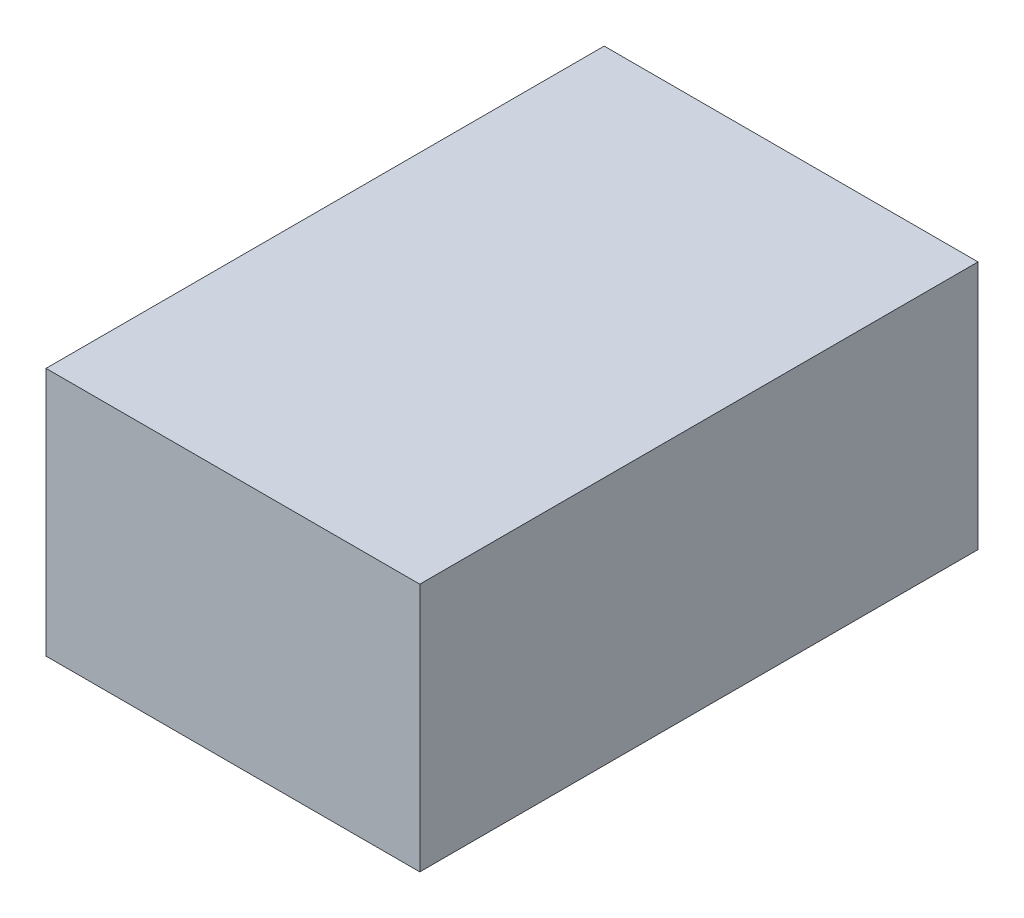
ISO-10303-21;
HEADER;
FILE_DESCRIPTION(('STEP AP214'),'2;1');
FILE_NAME('part.step','',(''),(''),'','','');
FILE_SCHEMA(('AUTOMOTIVE_DESIGN { 1 0 10303 214 1 1 1 1 }'));
ENDSEC;
DATA;
#1=APPLICATION_CONTEXT('core data for automotive mechanical design processes');
#2=APPLICATION_PROTOCOL_DEFINITION('international standard','automotive_design',2000,#1);
#3=PRODUCT_CONTEXT('',#1,'mechanical');
#4=PRODUCT('Part','Part','',(#3));
#5=PRODUCT_RELATED_PRODUCT_CATEGORY('part','',(#4));
#6=PRODUCT_DEFINITION_FORMATION('','',#4);
#7=PRODUCT_DEFINITION_CONTEXT('part definition',#1,'design');
#8=PRODUCT_DEFINITION('design','',#6,#7);
#9=PRODUCT_DEFINITION_SHAPE('','',#8);
#10=(LENGTH_UNIT() NAMED_UNIT(*) SI_UNIT(.MILLI.,.METRE.));
#11=(NAMED_UNIT(*) PLANE_ANGLE_UNIT() SI_UNIT($,.RADIAN.));
#12=(NAMED_UNIT(*) SI_UNIT($,.STERADIAN.) SOLID_ANGLE_UNIT());
#13=UNCERTAINTY_MEASURE_WITH_UNIT(LENGTH_MEASURE(1.E-05),#10,'distance_accuracy_value','');
#14=(GEOMETRIC_REPRESENTATION_CONTEXT(3) GLOBAL_UNCERTAINTY_ASSIGNED_CONTEXT((#13)) GLOBAL_UNIT_ASSIGNED_CONTEXT((#10,
#11,#12)) REPRESENTATION_CONTEXT('',''));
#15=CARTESIAN_POINT('',(0.,0.,0.));
#16=DIRECTION('',(0.,0.,1.));
#17=DIRECTION('',(1.,0.,0.));
#18=AXIS2_PLACEMENT_3D('',#15,#16,#17);
#19=CARTESIAN_POINT('',(25.14,2.77,14.48));
#20=DIRECTION('',(0.,1.,0.));
#21=DIRECTION('',(0.,0.,1.));
#22=AXIS2_PLACEMENT_3D('',#19,#20,#21);
#23=PLANE('',#22);
#24=DIRECTION('',(0.,0.,-1.));
#25=VECTOR('',#24,1.);
#26=CARTESIAN_POINT('',(29.78,2.77,15.6));
#27=LINE('',#26,#25);
#28=CARTESIAN_POINT('',(29.78,2.77,13.36));
#29=VERTEX_POINT('',#28);
#30=CARTESIAN_POINT('',(29.78,2.77,15.6));
#31=VERTEX_POINT('',#30);
#32=EDGE_CURVE('E20',#29,#31,#27,.F.);
#33=ORIENTED_EDGE('',*,*,#32,.F.);
#34=DIRECTION('',(-1.,0.,0.));
#35=VECTOR('',#34,1.);
#36=CARTESIAN_POINT('',(29.78,2.77,13.36));
#37=LINE('',#36,#35);
#38=CARTESIAN_POINT('',(28.28,2.77,13.36));
#39=VERTEX_POINT('',#38);
#40=EDGE_CURVE('E58',#39,#29,#37,.F.);
#41=ORIENTED_EDGE('',*,*,#40,.F.);
#42=DIRECTION('',(0.,0.,1.));
#43=VECTOR('',#42,1.);
#44=CARTESIAN_POINT('',(28.28,2.77,13.36));
#45=LINE('',#44,#43);
#46=CARTESIAN_POINT('',(28.28,2.77,15.6));
#47=VERTEX_POINT('',#46);
#48=EDGE_CURVE('E53',#47,#39,#45,.F.);
#49=ORIENTED_EDGE('',*,*,#48,.F.);
#50=DIRECTION('',(1.,0.,0.));
#51=VECTOR('',#50,1.);
#52=CARTESIAN_POINT('',(28.28,2.77,15.6));
#53=LINE('',#52,#51);
#54=EDGE_CURVE('E68',#31,#47,#53,.F.);
#55=ORIENTED_EDGE('',*,*,#54,.F.);
#56=EDGE_LOOP('',(#33,#41,#49,#55));
#57=FACE_BOUND('',#56,.T.);
#58=ADVANCED_FACE('F17',(#57),#23,.T.);
#59=CARTESIAN_POINT('',(29.78,1.77,15.6));
#60=DIRECTION('',(1.,0.,0.));
#61=DIRECTION('',(0.,0.,-1.));
#62=AXIS2_PLACEMENT_3D('',#59,#60,#61);
#63=PLANE('',#62);
#64=DIRECTION('',(0.,0.,1.));
#65=VECTOR('',#64,1.);
#66=CARTESIAN_POINT('',(29.78,1.77,14.48));
#67=LINE('',#66,#65);
#68=CARTESIAN_POINT('',(29.78,1.77,15.6));
#69=VERTEX_POINT('',#68);
#70=CARTESIAN_POINT('',(29.78,1.77,13.36));
#71=VERTEX_POINT('',#70);
#72=EDGE_CURVE('E74',#69,#71,#67,.F.);
#73=ORIENTED_EDGE('',*,*,#72,.T.);
#74=DIRECTION('',(0.,1.,0.));
#75=VECTOR('',#74,1.);
#76=CARTESIAN_POINT('',(29.78,1.77,13.36));
#77=LINE('',#76,#75);
#78=EDGE_CURVE('E63',#29,#71,#77,.F.);
#79=ORIENTED_EDGE('',*,*,#78,.F.);
#80=ORIENTED_EDGE('',*,*,#32,.T.);
#81=DIRECTION('',(0.,1.,0.));
#82=VECTOR('',#81,1.);
#83=CARTESIAN_POINT('',(29.78,1.77,15.6));
#84=LINE('',#83,#82);
#85=EDGE_CURVE('E81',#69,#31,#84,.T.);
#86=ORIENTED_EDGE('',*,*,#85,.F.);
#87=EDGE_LOOP('',(#73,#79,#80,#86));
#88=FACE_BOUND('',#87,.T.);
#89=ADVANCED_FACE('F73',(#88),#63,.T.);
#90=CARTESIAN_POINT('',(29.78,1.77,13.36));
#91=DIRECTION('',(0.,0.,-1.));
#92=DIRECTION('',(-1.,0.,0.));
#93=AXIS2_PLACEMENT_3D('',#90,#91,#92);
#94=PLANE('',#93);
#95=DIRECTION('',(1.,0.,0.));
#96=VECTOR('',#95,1.);
#97=CARTESIAN_POINT('',(29.03,1.77,13.36));
#98=LINE('',#97,#96);
#99=CARTESIAN_POINT('',(28.28,1.77,13.36));
#100=VERTEX_POINT('',#99);
#101=EDGE_CURVE('E84',#71,#100,#98,.F.);
#102=ORIENTED_EDGE('',*,*,#101,.T.);
#103=DIRECTION('',(0.,1.,0.));
#104=VECTOR('',#103,1.);
#105=CARTESIAN_POINT('',(28.28,1.77,13.36));
#106=LINE('',#105,#104);
#107=EDGE_CURVE('E65',#39,#100,#106,.F.);
#108=ORIENTED_EDGE('',*,*,#107,.F.);
#109=ORIENTED_EDGE('',*,*,#40,.T.);
#110=ORIENTED_EDGE('',*,*,#78,.T.);
#111=EDGE_LOOP('',(#102,#108,#109,#110));
#112=FACE_BOUND('',#111,.T.);
#113=ADVANCED_FACE('F61',(#112),#94,.T.);
#114=CARTESIAN_POINT('',(28.28,1.77,13.36));
#115=DIRECTION('',(-1.,0.,0.));
#116=DIRECTION('',(0.,0.,1.));
#117=AXIS2_PLACEMENT_3D('',#114,#115,#116);
#118=PLANE('',#117);
#119=DIRECTION('',(0.,0.,1.));
#120=VECTOR('',#119,1.);
#121=CARTESIAN_POINT('',(28.28,1.77,14.48));
#122=LINE('',#121,#120);
#123=CARTESIAN_POINT('',(28.28,1.77,15.6));
#124=VERTEX_POINT('',#123);
#125=EDGE_CURVE('E26',#100,#124,#122,.T.);
#126=ORIENTED_EDGE('',*,*,#125,.T.);
#127=DIRECTION('',(0.,1.,0.));
#128=VECTOR('',#127,1.);
#129=CARTESIAN_POINT('',(28.28,1.77,15.6));
#130=LINE('',#129,#128);
#131=EDGE_CURVE('E34',#47,#124,#130,.F.);
#132=ORIENTED_EDGE('',*,*,#131,.F.);
#133=ORIENTED_EDGE('',*,*,#48,.T.);
#134=ORIENTED_EDGE('',*,*,#107,.T.);
#135=EDGE_LOOP('',(#126,#132,#133,#134));
#136=FACE_BOUND('',#135,.T.);
#137=ADVANCED_FACE('F88',(#136),#118,.T.);
#138=CARTESIAN_POINT('',(28.28,1.77,15.6));
#139=DIRECTION('',(0.,0.,1.));
#140=DIRECTION('',(1.,0.,0.));
#141=AXIS2_PLACEMENT_3D('',#138,#139,#140);
#142=PLANE('',#141);
#143=DIRECTION('',(1.,0.,0.));
#144=VECTOR('',#143,1.);
#145=CARTESIAN_POINT('',(29.03,1.77,15.6));
#146=LINE('',#145,#144);
#147=EDGE_CURVE('E11',#124,#69,#146,.T.);
#148=ORIENTED_EDGE('',*,*,#147,.T.);
#149=ORIENTED_EDGE('',*,*,#85,.T.);
#150=ORIENTED_EDGE('',*,*,#54,.T.);
#151=ORIENTED_EDGE('',*,*,#131,.T.);
#152=EDGE_LOOP('',(#148,#149,#150,#151));
#153=FACE_BOUND('',#152,.T.);
#154=ADVANCED_FACE('F91',(#153),#142,.T.);
#155=CARTESIAN_POINT('',(29.03,1.77,14.48));
#156=DIRECTION('',(0.,1.,0.));
#157=DIRECTION('',(0.,0.,1.));
#158=AXIS2_PLACEMENT_3D('',#155,#156,#157);
#159=PLANE('',#158);
#160=ORIENTED_EDGE('',*,*,#125,.F.);
#161=ORIENTED_EDGE('',*,*,#101,.F.);
#162=ORIENTED_EDGE('',*,*,#72,.F.);
#163=ORIENTED_EDGE('',*,*,#147,.F.);
#164=EDGE_LOOP('',(#160,#161,#162,#163));
#165=FACE_BOUND('',#164,.T.);
#166=ADVANCED_FACE('F90',(#165),#159,.F.);
#167=CLOSED_SHELL('',(#58,#89,#113,#137,#154,#166));
#168=MANIFOLD_SOLID_BREP('B1',#167);
#169=ADVANCED_BREP_SHAPE_REPRESENTATION('',(#18,#168),#14);
#170=SHAPE_DEFINITION_REPRESENTATION(#9,#169);
ENDSEC;
END-ISO-10303-21;
